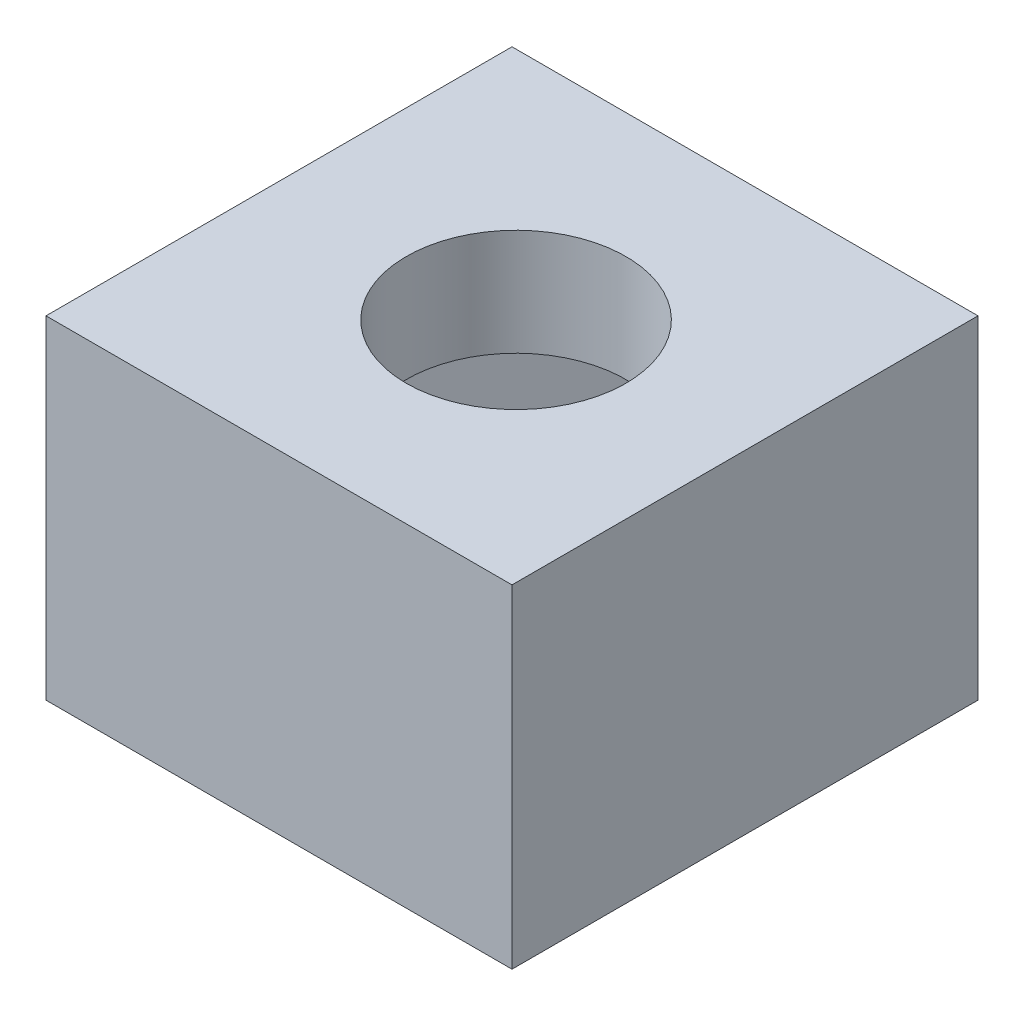
ISO-10303-21;
HEADER;
FILE_DESCRIPTION(('STEP AP214'),'2;1');
FILE_NAME('part.step','',(''),(''),'','','');
FILE_SCHEMA(('AUTOMOTIVE_DESIGN { 1 0 10303 214 1 1 1 1 }'));
ENDSEC;
DATA;
#1=APPLICATION_CONTEXT('core data for automotive mechanical design processes');
#2=APPLICATION_PROTOCOL_DEFINITION('international standard','automotive_design',2000,#1);
#3=PRODUCT_CONTEXT('',#1,'mechanical');
#4=PRODUCT('Part','Part','',(#3));
#5=PRODUCT_RELATED_PRODUCT_CATEGORY('part','',(#4));
#6=PRODUCT_DEFINITION_FORMATION('','',#4);
#7=PRODUCT_DEFINITION_CONTEXT('part definition',#1,'design');
#8=PRODUCT_DEFINITION('design','',#6,#7);
#9=PRODUCT_DEFINITION_SHAPE('','',#8);
#10=(LENGTH_UNIT() NAMED_UNIT(*) SI_UNIT(.MILLI.,.METRE.));
#11=(NAMED_UNIT(*) PLANE_ANGLE_UNIT() SI_UNIT($,.RADIAN.));
#12=(NAMED_UNIT(*) SI_UNIT($,.STERADIAN.) SOLID_ANGLE_UNIT());
#13=UNCERTAINTY_MEASURE_WITH_UNIT(LENGTH_MEASURE(1.E-05),#10,'distance_accuracy_value','');
#14=(GEOMETRIC_REPRESENTATION_CONTEXT(3) GLOBAL_UNCERTAINTY_ASSIGNED_CONTEXT((#13)) GLOBAL_UNIT_ASSIGNED_CONTEXT((#10,
#11,#12)) REPRESENTATION_CONTEXT('',''));
#15=CARTESIAN_POINT('',(0.,0.,0.));
#16=DIRECTION('',(0.,0.,1.));
#17=DIRECTION('',(1.,0.,0.));
#18=AXIS2_PLACEMENT_3D('',#15,#16,#17);
#19=CARTESIAN_POINT('',(-4.17779660960651,5.,-1.37171277354378));
#20=DIRECTION('',(1.,0.,0.));
#21=DIRECTION('',(0.,0.,-1.));
#22=AXIS2_PLACEMENT_3D('',#19,#20,#21);
#23=PLANE('',#22);
#24=DIRECTION('',(0.,0.,1.));
#25=VECTOR('',#24,1.);
#26=CARTESIAN_POINT('',(-4.17779660960651,0.,-1.37171277354378));
#27=LINE('',#26,#25);
#28=CARTESIAN_POINT('',(-4.17779660960651,0.,-1.37171277354378));
#29=VERTEX_POINT('',#28);
#30=CARTESIAN_POINT('',(-4.17779660960651,0.,5.62828722645622));
#31=VERTEX_POINT('',#30);
#32=EDGE_CURVE('E162',#29,#31,#27,.T.);
#33=ORIENTED_EDGE('',*,*,#32,.T.);
#34=DIRECTION('',(0.,-1.,0.));
#35=VECTOR('',#34,1.);
#36=CARTESIAN_POINT('',(-4.17779660960651,5.,5.62828722645622));
#37=LINE('',#36,#35);
#38=CARTESIAN_POINT('',(-4.17779660960651,5.,5.62828722645622));
#39=VERTEX_POINT('',#38);
#40=EDGE_CURVE('E11',#39,#31,#37,.T.);
#41=ORIENTED_EDGE('',*,*,#40,.F.);
#42=DIRECTION('',(0.,0.,1.));
#43=VECTOR('',#42,1.);
#44=CARTESIAN_POINT('',(-4.17779660960651,5.,-1.37171277354378));
#45=LINE('',#44,#43);
#46=CARTESIAN_POINT('',(-4.17779660960651,5.,-1.37171277354378));
#47=VERTEX_POINT('',#46);
#48=EDGE_CURVE('E171',#47,#39,#45,.T.);
#49=ORIENTED_EDGE('',*,*,#48,.F.);
#50=DIRECTION('',(0.,-1.,0.));
#51=VECTOR('',#50,1.);
#52=CARTESIAN_POINT('',(-4.17779660960651,5.,-1.37171277354378));
#53=LINE('',#52,#51);
#54=EDGE_CURVE('E181',#47,#29,#53,.T.);
#55=ORIENTED_EDGE('',*,*,#54,.T.);
#56=EDGE_LOOP('',(#33,#41,#49,#55));
#57=FACE_BOUND('',#56,.T.);
#58=ADVANCED_FACE('F35',(#57),#23,.F.);
#59=CARTESIAN_POINT('',(-4.17779660960651,5.,5.62828722645622));
#60=DIRECTION('',(0.,0.,-1.));
#61=DIRECTION('',(-1.,0.,0.));
#62=AXIS2_PLACEMENT_3D('',#59,#60,#61);
#63=PLANE('',#62);
#64=DIRECTION('',(1.,0.,0.));
#65=VECTOR('',#64,1.);
#66=CARTESIAN_POINT('',(-4.17779660960651,0.,5.62828722645622));
#67=LINE('',#66,#65);
#68=CARTESIAN_POINT('',(2.82220339039349,0.,5.62828722645622));
#69=VERTEX_POINT('',#68);
#70=EDGE_CURVE('E184',#31,#69,#67,.T.);
#71=ORIENTED_EDGE('',*,*,#70,.T.);
#72=DIRECTION('',(0.,-1.,0.));
#73=VECTOR('',#72,1.);
#74=CARTESIAN_POINT('',(2.82220339039349,5.,5.62828722645622));
#75=LINE('',#74,#73);
#76=CARTESIAN_POINT('',(2.82220339039349,5.,5.62828722645622));
#77=VERTEX_POINT('',#76);
#78=EDGE_CURVE('E42',#77,#69,#75,.T.);
#79=ORIENTED_EDGE('',*,*,#78,.F.);
#80=DIRECTION('',(1.,0.,0.));
#81=VECTOR('',#80,1.);
#82=CARTESIAN_POINT('',(-4.17779660960651,5.,5.62828722645622));
#83=LINE('',#82,#81);
#84=EDGE_CURVE('E174',#39,#77,#83,.T.);
#85=ORIENTED_EDGE('',*,*,#84,.F.);
#86=ORIENTED_EDGE('',*,*,#40,.T.);
#87=EDGE_LOOP('',(#71,#79,#85,#86));
#88=FACE_BOUND('',#87,.T.);
#89=ADVANCED_FACE('F215',(#88),#63,.F.);
#90=CARTESIAN_POINT('',(2.82220339039349,5.,-1.37171277354378));
#91=DIRECTION('',(-1.,0.,0.));
#92=DIRECTION('',(0.,0.,1.));
#93=AXIS2_PLACEMENT_3D('',#90,#91,#92);
#94=PLANE('',#93);
#95=DIRECTION('',(0.,0.,-1.));
#96=VECTOR('',#95,1.);
#97=CARTESIAN_POINT('',(2.82220339039349,0.,-1.37171277354378));
#98=LINE('',#97,#96);
#99=CARTESIAN_POINT('',(2.82220339039349,0.,-1.37171277354378));
#100=VERTEX_POINT('',#99);
#101=EDGE_CURVE('E186',#69,#100,#98,.T.);
#102=ORIENTED_EDGE('',*,*,#101,.T.);
#103=DIRECTION('',(0.,-1.,0.));
#104=VECTOR('',#103,1.);
#105=CARTESIAN_POINT('',(2.82220339039349,5.,-1.37171277354378));
#106=LINE('',#105,#104);
#107=CARTESIAN_POINT('',(2.82220339039349,5.,-1.37171277354378));
#108=VERTEX_POINT('',#107);
#109=EDGE_CURVE('E191',#108,#100,#106,.T.);
#110=ORIENTED_EDGE('',*,*,#109,.F.);
#111=DIRECTION('',(0.,0.,-1.));
#112=VECTOR('',#111,1.);
#113=CARTESIAN_POINT('',(2.82220339039349,5.,-1.37171277354378));
#114=LINE('',#113,#112);
#115=EDGE_CURVE('E177',#77,#108,#114,.T.);
#116=ORIENTED_EDGE('',*,*,#115,.F.);
#117=ORIENTED_EDGE('',*,*,#78,.T.);
#118=EDGE_LOOP('',(#102,#110,#116,#117));
#119=FACE_BOUND('',#118,.T.);
#120=ADVANCED_FACE('F198',(#119),#94,.F.);
#121=CARTESIAN_POINT('',(-4.17779660960651,5.,-1.37171277354378));
#122=DIRECTION('',(0.,0.,1.));
#123=DIRECTION('',(1.,0.,0.));
#124=AXIS2_PLACEMENT_3D('',#121,#122,#123);
#125=PLANE('',#124);
#126=DIRECTION('',(-1.,0.,0.));
#127=VECTOR('',#126,1.);
#128=CARTESIAN_POINT('',(-4.17779660960651,0.,-1.37171277354378));
#129=LINE('',#128,#127);
#130=EDGE_CURVE('E175',#100,#29,#129,.T.);
#131=ORIENTED_EDGE('',*,*,#130,.T.);
#132=ORIENTED_EDGE('',*,*,#54,.F.);
#133=DIRECTION('',(-1.,0.,0.));
#134=VECTOR('',#133,1.);
#135=CARTESIAN_POINT('',(-4.17779660960651,5.,-1.37171277354378));
#136=LINE('',#135,#134);
#137=EDGE_CURVE('E179',#108,#47,#136,.T.);
#138=ORIENTED_EDGE('',*,*,#137,.F.);
#139=ORIENTED_EDGE('',*,*,#109,.T.);
#140=EDGE_LOOP('',(#131,#132,#138,#139));
#141=FACE_BOUND('',#140,.T.);
#142=ADVANCED_FACE('F207',(#141),#125,.F.);
#143=CARTESIAN_POINT('',(0.,5.,0.));
#144=DIRECTION('',(0.,1.,0.));
#145=DIRECTION('',(0.,0.,1.));
#146=AXIS2_PLACEMENT_3D('',#143,#144,#145);
#147=PLANE('',#146);
#148=ORIENTED_EDGE('',*,*,#48,.T.);
#149=ORIENTED_EDGE('',*,*,#84,.T.);
#150=ORIENTED_EDGE('',*,*,#115,.T.);
#151=ORIENTED_EDGE('',*,*,#137,.T.);
#152=EDGE_LOOP('',(#148,#149,#150,#151));
#153=FACE_BOUND('',#152,.T.);
#154=CARTESIAN_POINT('',(-0.594144979232732,5.,2.15070161326042));
#155=DIRECTION('',(0.,1.,0.));
#156=DIRECTION('',(0.,0.,1.));
#157=AXIS2_PLACEMENT_3D('',#154,#155,#156);
#158=CIRCLE('',#157,1.65);
#159=CARTESIAN_POINT('',(-0.594144979232732,5.,3.80070161326042));
#160=VERTEX_POINT('',#159);
#161=EDGE_CURVE('E145',#160,#160,#158,.T.);
#162=ORIENTED_EDGE('',*,*,#161,.F.);
#163=EDGE_LOOP('',(#162));
#164=FACE_BOUND('',#163,.T.);
#165=ADVANCED_FACE('F213',(#153,#164),#147,.T.);
#166=CARTESIAN_POINT('',(0.,0.,0.));
#167=DIRECTION('',(0.,1.,0.));
#168=DIRECTION('',(0.,0.,1.));
#169=AXIS2_PLACEMENT_3D('',#166,#167,#168);
#170=PLANE('',#169);
#171=ORIENTED_EDGE('',*,*,#32,.F.);
#172=ORIENTED_EDGE('',*,*,#130,.F.);
#173=ORIENTED_EDGE('',*,*,#101,.F.);
#174=ORIENTED_EDGE('',*,*,#70,.F.);
#175=EDGE_LOOP('',(#171,#172,#173,#174));
#176=FACE_BOUND('',#175,.T.);
#177=ADVANCED_FACE('F204',(#176),#170,.F.);
#178=CARTESIAN_POINT('',(-0.594144979232732,3.4,2.15070161326042));
#179=DIRECTION('',(0.,1.,0.));
#180=DIRECTION('',(0.,0.,1.));
#181=AXIS2_PLACEMENT_3D('',#178,#179,#180);
#182=CYLINDRICAL_SURFACE('',#181,1.65);
#183=CARTESIAN_POINT('',(-0.594144979232732,3.4,2.15070161326042));
#184=DIRECTION('',(0.,1.,0.));
#185=DIRECTION('',(0.,0.,1.));
#186=AXIS2_PLACEMENT_3D('',#183,#184,#185);
#187=CIRCLE('',#186,1.65);
#188=CARTESIAN_POINT('',(-0.594144979232732,3.4,3.80070161326042));
#189=VERTEX_POINT('',#188);
#190=EDGE_CURVE('E130',#189,#189,#187,.T.);
#191=ORIENTED_EDGE('',*,*,#190,.F.);
#192=EDGE_LOOP('',(#191));
#193=FACE_BOUND('',#192,.T.);
#194=ORIENTED_EDGE('',*,*,#161,.T.);
#195=EDGE_LOOP('',(#194));
#196=FACE_BOUND('',#195,.T.);
#197=ADVANCED_FACE('F227',(#193,#196),#182,.F.);
#198=CARTESIAN_POINT('',(0.,3.4,0.));
#199=DIRECTION('',(0.,1.,0.));
#200=DIRECTION('',(0.,0.,1.));
#201=AXIS2_PLACEMENT_3D('',#198,#199,#200);
#202=PLANE('',#201);
#203=ORIENTED_EDGE('',*,*,#190,.T.);
#204=EDGE_LOOP('',(#203));
#205=FACE_BOUND('',#204,.T.);
#206=DIRECTION('',(-0.965925826289068,0.,-0.258819045102521));
#207=VECTOR('',#206,1.);
#208=CARTESIAN_POINT('',(0.134276803873722,3.4,-0.501127854334693));
#209=LINE('',#208,#207);
#210=CARTESIAN_POINT('',(1.65122061831851,3.4,-0.094663984290826));
#211=VERTEX_POINT('',#210);
#212=CARTESIAN_POINT('',(-1.41600582872011,3.4,-0.916524833778207));
#213=VERTEX_POINT('',#212);
#214=EDGE_CURVE('E126',#211,#213,#209,.T.);
#215=ORIENTED_EDGE('',*,*,#214,.F.);
#216=DIRECTION('',(-0.258819045102521,0.,-0.965925826289068));
#217=VECTOR('',#216,1.);
#218=CARTESIAN_POINT('',(1.5642758065902,3.4,-0.419146439115388));
#219=LINE('',#218,#217);
#220=CARTESIAN_POINT('',(2.47308146780589,3.4,2.9725624627478));
#221=VERTEX_POINT('',#220);
#222=EDGE_CURVE('E49',#221,#211,#219,.T.);
#223=ORIENTED_EDGE('',*,*,#222,.F.);
#224=DIRECTION('',(0.707106781186548,0.,-0.707106781186548));
#225=VECTOR('',#224,1.);
#226=CARTESIAN_POINT('',(2.72282196527685,3.4,2.72282196527685));
#227=LINE('',#226,#225);
#228=CARTESIAN_POINT('',(0.227715870254649,3.4,5.21792806029905));
#229=VERTEX_POINT('',#228);
#230=EDGE_CURVE('E57',#229,#221,#227,.T.);
#231=ORIENTED_EDGE('',*,*,#230,.F.);
#232=DIRECTION('',(0.965925826289068,0.,0.258819045102521));
#233=VECTOR('',#232,1.);
#234=CARTESIAN_POINT('',(-1.28922794419014,3.4,4.81146419025518));
#235=LINE('',#234,#233);
#236=CARTESIAN_POINT('',(-2.83951057678398,3.4,4.39606721081167));
#237=VERTEX_POINT('',#236);
#238=EDGE_CURVE('E137',#237,#229,#235,.T.);
#239=ORIENTED_EDGE('',*,*,#238,.F.);
#240=DIRECTION('',(0.258819045102521,0.,0.965925826289068));
#241=VECTOR('',#240,1.);
#242=CARTESIAN_POINT('',(-3.74831623799967,3.4,1.00435830894847));
#243=LINE('',#242,#241);
#244=CARTESIAN_POINT('',(-3.66137142627136,3.4,1.32884076377304));
#245=VERTEX_POINT('',#244);
#246=EDGE_CURVE('E135',#245,#237,#243,.T.);
#247=ORIENTED_EDGE('',*,*,#246,.F.);
#248=DIRECTION('',(-0.707106781186547,0.,0.707106781186548));
#249=VECTOR('',#248,1.);
#250=CARTESIAN_POINT('',(-1.16626533124916,3.4,-1.16626533124916));
#251=LINE('',#250,#249);
#252=EDGE_CURVE('E115',#213,#245,#251,.T.);
#253=ORIENTED_EDGE('',*,*,#252,.F.);
#254=EDGE_LOOP('',(#215,#223,#231,#239,#247,#253));
#255=FACE_BOUND('',#254,.T.);
#256=ADVANCED_FACE('F133',(#205,#255),#202,.F.);
#257=CARTESIAN_POINT('',(0.,1.,0.));
#258=DIRECTION('',(0.,1.,0.));
#259=DIRECTION('',(0.,0.,1.));
#260=AXIS2_PLACEMENT_3D('',#257,#258,#259);
#261=PLANE('',#260);
#262=DIRECTION('',(-0.965925826289068,0.,-0.258819045102521));
#263=VECTOR('',#262,1.);
#264=CARTESIAN_POINT('',(1.65122061831851,1.,-0.094663984290826));
#265=LINE('',#264,#263);
#266=CARTESIAN_POINT('',(1.65122061831851,1.,-0.094663984290826));
#267=VERTEX_POINT('',#266);
#268=CARTESIAN_POINT('',(-1.41600582872012,1.,-0.916524833778208));
#269=VERTEX_POINT('',#268);
#270=EDGE_CURVE('E144',#267,#269,#265,.T.);
#271=ORIENTED_EDGE('',*,*,#270,.T.);
#272=DIRECTION('',(-0.707106781186547,0.,0.707106781186548));
#273=VECTOR('',#272,1.);
#274=CARTESIAN_POINT('',(-1.41600582872012,1.,-0.916524833778208));
#275=LINE('',#274,#273);
#276=CARTESIAN_POINT('',(-3.66137142627136,1.,1.32884076377304));
#277=VERTEX_POINT('',#276);
#278=EDGE_CURVE('E118',#269,#277,#275,.T.);
#279=ORIENTED_EDGE('',*,*,#278,.T.);
#280=DIRECTION('',(0.258819045102521,0.,0.965925826289068));
#281=VECTOR('',#280,1.);
#282=CARTESIAN_POINT('',(-3.66137142627136,1.,1.32884076377304));
#283=LINE('',#282,#281);
#284=CARTESIAN_POINT('',(-2.83951057678398,1.,4.39606721081167));
#285=VERTEX_POINT('',#284);
#286=EDGE_CURVE('E150',#277,#285,#283,.T.);
#287=ORIENTED_EDGE('',*,*,#286,.T.);
#288=DIRECTION('',(0.965925826289068,0.,0.258819045102521));
#289=VECTOR('',#288,1.);
#290=CARTESIAN_POINT('',(-2.83951057678398,1.,4.39606721081167));
#291=LINE('',#290,#289);
#292=CARTESIAN_POINT('',(0.227715870254649,1.,5.21792806029905));
#293=VERTEX_POINT('',#292);
#294=EDGE_CURVE('E153',#285,#293,#291,.T.);
#295=ORIENTED_EDGE('',*,*,#294,.T.);
#296=DIRECTION('',(0.707106781186547,0.,-0.707106781186548));
#297=VECTOR('',#296,1.);
#298=CARTESIAN_POINT('',(0.227715870254649,1.,5.21792806029905));
#299=LINE('',#298,#297);
#300=CARTESIAN_POINT('',(2.47308146780589,1.,2.9725624627478));
#301=VERTEX_POINT('',#300);
#302=EDGE_CURVE('E156',#293,#301,#299,.T.);
#303=ORIENTED_EDGE('',*,*,#302,.T.);
#304=DIRECTION('',(-0.258819045102521,0.,-0.965925826289068));
#305=VECTOR('',#304,1.);
#306=CARTESIAN_POINT('',(2.47308146780589,1.,2.9725624627478));
#307=LINE('',#306,#305);
#308=EDGE_CURVE('E123',#301,#267,#307,.T.);
#309=ORIENTED_EDGE('',*,*,#308,.T.);
#310=EDGE_LOOP('',(#271,#279,#287,#295,#303,#309));
#311=FACE_BOUND('',#310,.T.);
#312=ADVANCED_FACE('F236',(#311),#261,.T.);
#313=CARTESIAN_POINT('',(-1.41600582872012,1.,-0.916524833778208));
#314=DIRECTION('',(-0.707106781186548,0.,-0.707106781186547));
#315=DIRECTION('',(-0.707106781186547,0.,0.707106781186548));
#316=AXIS2_PLACEMENT_3D('',#313,#314,#315);
#317=PLANE('',#316);
#318=ORIENTED_EDGE('',*,*,#252,.T.);
#319=DIRECTION('',(0.,1.,0.));
#320=VECTOR('',#319,1.);
#321=CARTESIAN_POINT('',(-3.66137142627136,1.,1.32884076377304));
#322=LINE('',#321,#320);
#323=EDGE_CURVE('E122',#277,#245,#322,.T.);
#324=ORIENTED_EDGE('',*,*,#323,.F.);
#325=ORIENTED_EDGE('',*,*,#278,.F.);
#326=DIRECTION('',(0.,1.,0.));
#327=VECTOR('',#326,1.);
#328=CARTESIAN_POINT('',(-1.41600582872012,1.,-0.916524833778208));
#329=LINE('',#328,#327);
#330=EDGE_CURVE('E111',#269,#213,#329,.T.);
#331=ORIENTED_EDGE('',*,*,#330,.T.);
#332=EDGE_LOOP('',(#318,#324,#325,#331));
#333=FACE_BOUND('',#332,.T.);
#334=ADVANCED_FACE('F113',(#333),#317,.F.);
#335=CARTESIAN_POINT('',(-3.66137142627136,1.,1.32884076377304));
#336=DIRECTION('',(-0.965925826289068,0.,0.258819045102521));
#337=DIRECTION('',(0.258819045102521,0.,0.965925826289068));
#338=AXIS2_PLACEMENT_3D('',#335,#336,#337);
#339=PLANE('',#338);
#340=ORIENTED_EDGE('',*,*,#246,.T.);
#341=DIRECTION('',(0.,1.,0.));
#342=VECTOR('',#341,1.);
#343=CARTESIAN_POINT('',(-2.83951057678398,1.,4.39606721081167));
#344=LINE('',#343,#342);
#345=EDGE_CURVE('E167',#285,#237,#344,.T.);
#346=ORIENTED_EDGE('',*,*,#345,.F.);
#347=ORIENTED_EDGE('',*,*,#286,.F.);
#348=ORIENTED_EDGE('',*,*,#323,.T.);
#349=EDGE_LOOP('',(#340,#346,#347,#348));
#350=FACE_BOUND('',#349,.T.);
#351=ADVANCED_FACE('F235',(#350),#339,.F.);
#352=CARTESIAN_POINT('',(-2.83951057678398,1.,4.39606721081167));
#353=DIRECTION('',(-0.258819045102521,0.,0.965925826289068));
#354=DIRECTION('',(0.965925826289068,0.,0.258819045102521));
#355=AXIS2_PLACEMENT_3D('',#352,#353,#354);
#356=PLANE('',#355);
#357=ORIENTED_EDGE('',*,*,#238,.T.);
#358=DIRECTION('',(0.,1.,0.));
#359=VECTOR('',#358,1.);
#360=CARTESIAN_POINT('',(0.227715870254649,1.,5.21792806029905));
#361=LINE('',#360,#359);
#362=EDGE_CURVE('E165',#293,#229,#361,.T.);
#363=ORIENTED_EDGE('',*,*,#362,.F.);
#364=ORIENTED_EDGE('',*,*,#294,.F.);
#365=ORIENTED_EDGE('',*,*,#345,.T.);
#366=EDGE_LOOP('',(#357,#363,#364,#365));
#367=FACE_BOUND('',#366,.T.);
#368=ADVANCED_FACE('F239',(#367),#356,.F.);
#369=CARTESIAN_POINT('',(0.227715870254649,1.,5.21792806029905));
#370=DIRECTION('',(0.707106781186548,0.,0.707106781186547));
#371=DIRECTION('',(0.707106781186547,0.,-0.707106781186548));
#372=AXIS2_PLACEMENT_3D('',#369,#370,#371);
#373=PLANE('',#372);
#374=ORIENTED_EDGE('',*,*,#230,.T.);
#375=DIRECTION('',(0.,1.,0.));
#376=VECTOR('',#375,1.);
#377=CARTESIAN_POINT('',(2.47308146780589,1.,2.9725624627478));
#378=LINE('',#377,#376);
#379=EDGE_CURVE('E163',#301,#221,#378,.T.);
#380=ORIENTED_EDGE('',*,*,#379,.F.);
#381=ORIENTED_EDGE('',*,*,#302,.F.);
#382=ORIENTED_EDGE('',*,*,#362,.T.);
#383=EDGE_LOOP('',(#374,#380,#381,#382));
#384=FACE_BOUND('',#383,.T.);
#385=ADVANCED_FACE('F243',(#384),#373,.F.);
#386=CARTESIAN_POINT('',(2.47308146780589,1.,2.9725624627478));
#387=DIRECTION('',(0.965925826289068,0.,-0.258819045102521));
#388=DIRECTION('',(-0.258819045102521,0.,-0.965925826289068));
#389=AXIS2_PLACEMENT_3D('',#386,#387,#388);
#390=PLANE('',#389);
#391=ORIENTED_EDGE('',*,*,#222,.T.);
#392=DIRECTION('',(0.,1.,0.));
#393=VECTOR('',#392,1.);
#394=CARTESIAN_POINT('',(1.65122061831851,1.,-0.094663984290826));
#395=LINE('',#394,#393);
#396=EDGE_CURVE('E128',#267,#211,#395,.T.);
#397=ORIENTED_EDGE('',*,*,#396,.F.);
#398=ORIENTED_EDGE('',*,*,#308,.F.);
#399=ORIENTED_EDGE('',*,*,#379,.T.);
#400=EDGE_LOOP('',(#391,#397,#398,#399));
#401=FACE_BOUND('',#400,.T.);
#402=ADVANCED_FACE('F232',(#401),#390,.F.);
#403=CARTESIAN_POINT('',(1.65122061831851,1.,-0.094663984290826));
#404=DIRECTION('',(0.258819045102521,0.,-0.965925826289068));
#405=DIRECTION('',(-0.965925826289068,0.,-0.258819045102521));
#406=AXIS2_PLACEMENT_3D('',#403,#404,#405);
#407=PLANE('',#406);
#408=ORIENTED_EDGE('',*,*,#214,.T.);
#409=ORIENTED_EDGE('',*,*,#330,.F.);
#410=ORIENTED_EDGE('',*,*,#270,.F.);
#411=ORIENTED_EDGE('',*,*,#396,.T.);
#412=EDGE_LOOP('',(#408,#409,#410,#411));
#413=FACE_BOUND('',#412,.T.);
#414=ADVANCED_FACE('F127',(#413),#407,.F.);
#415=CLOSED_SHELL('',(#58,#89,#120,#142,#165,#177,#197,#256,#312,#334,#351,#368,#385,#402,#414));
#416=MANIFOLD_SOLID_BREP('B2',#415);
#417=ADVANCED_BREP_SHAPE_REPRESENTATION('',(#18,#416),#14);
#418=SHAPE_DEFINITION_REPRESENTATION(#9,#417);
ENDSEC;
END-ISO-10303-21;
